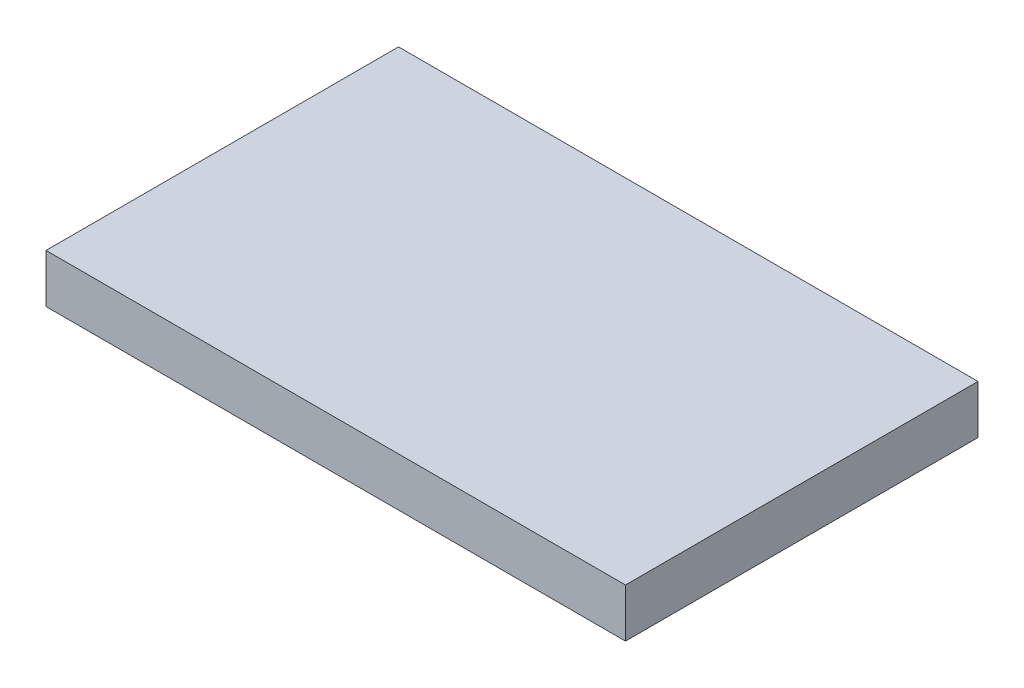
ISO-10303-21;
HEADER;
FILE_DESCRIPTION(('STEP AP214'),'2;1');
FILE_NAME('part.step','',(''),(''),'','','');
FILE_SCHEMA(('AUTOMOTIVE_DESIGN { 1 0 10303 214 1 1 1 1 }'));
ENDSEC;
DATA;
#1=APPLICATION_CONTEXT('core data for automotive mechanical design processes');
#2=APPLICATION_PROTOCOL_DEFINITION('international standard','automotive_design',2000,#1);
#3=PRODUCT_CONTEXT('',#1,'mechanical');
#4=PRODUCT('Part','Part','',(#3));
#5=PRODUCT_RELATED_PRODUCT_CATEGORY('part','',(#4));
#6=PRODUCT_DEFINITION_FORMATION('','',#4);
#7=PRODUCT_DEFINITION_CONTEXT('part definition',#1,'design');
#8=PRODUCT_DEFINITION('design','',#6,#7);
#9=PRODUCT_DEFINITION_SHAPE('','',#8);
#10=(LENGTH_UNIT() NAMED_UNIT(*) SI_UNIT(.MILLI.,.METRE.));
#11=(NAMED_UNIT(*) PLANE_ANGLE_UNIT() SI_UNIT($,.RADIAN.));
#12=(NAMED_UNIT(*) SI_UNIT($,.STERADIAN.) SOLID_ANGLE_UNIT());
#13=UNCERTAINTY_MEASURE_WITH_UNIT(LENGTH_MEASURE(1.E-05),#10,'distance_accuracy_value','');
#14=(GEOMETRIC_REPRESENTATION_CONTEXT(3) GLOBAL_UNCERTAINTY_ASSIGNED_CONTEXT((#13)) GLOBAL_UNIT_ASSIGNED_CONTEXT((#10,
#11,#12)) REPRESENTATION_CONTEXT('',''));
#15=CARTESIAN_POINT('',(0.,0.,0.));
#16=DIRECTION('',(0.,0.,1.));
#17=DIRECTION('',(1.,0.,0.));
#18=AXIS2_PLACEMENT_3D('',#15,#16,#17);
#19=CARTESIAN_POINT('',(124.620801033592,12.,-51.3989018087855));
#20=DIRECTION('',(0.,0.,1.));
#21=DIRECTION('',(1.,0.,0.));
#22=AXIS2_PLACEMENT_3D('',#19,#20,#21);
#23=PLANE('',#22);
#24=DIRECTION('',(-1.,0.,0.));
#25=VECTOR('',#24,1.);
#26=CARTESIAN_POINT('',(124.620801033592,0.,-51.3989018087855));
#27=LINE('',#26,#25);
#28=CARTESIAN_POINT('',(124.620801033592,0.,-51.3989018087855));
#29=VERTEX_POINT('',#28);
#30=CARTESIAN_POINT('',(-18.3791989664082,0.,-51.3989018087855));
#31=VERTEX_POINT('',#30);
#32=EDGE_CURVE('E95',#29,#31,#27,.T.);
#33=ORIENTED_EDGE('',*,*,#32,.T.);
#34=DIRECTION('',(0.,-1.,0.));
#35=VECTOR('',#34,1.);
#36=CARTESIAN_POINT('',(-18.3791989664082,12.,-51.3989018087855));
#37=LINE('',#36,#35);
#38=CARTESIAN_POINT('',(-18.3791989664082,12.,-51.3989018087855));
#39=VERTEX_POINT('',#38);
#40=EDGE_CURVE('E11',#39,#31,#37,.T.);
#41=ORIENTED_EDGE('',*,*,#40,.F.);
#42=DIRECTION('',(-1.,0.,0.));
#43=VECTOR('',#42,1.);
#44=CARTESIAN_POINT('',(124.620801033592,12.,-51.3989018087855));
#45=LINE('',#44,#43);
#46=CARTESIAN_POINT('',(124.620801033592,12.,-51.3989018087855));
#47=VERTEX_POINT('',#46);
#48=EDGE_CURVE('E83',#47,#39,#45,.T.);
#49=ORIENTED_EDGE('',*,*,#48,.F.);
#50=DIRECTION('',(0.,-1.,0.));
#51=VECTOR('',#50,1.);
#52=CARTESIAN_POINT('',(124.620801033592,12.,-51.3989018087855));
#53=LINE('',#52,#51);
#54=EDGE_CURVE('E91',#47,#29,#53,.T.);
#55=ORIENTED_EDGE('',*,*,#54,.T.);
#56=EDGE_LOOP('',(#33,#41,#49,#55));
#57=FACE_BOUND('',#56,.T.);
#58=ADVANCED_FACE('F32',(#57),#23,.F.);
#59=CARTESIAN_POINT('',(-18.3791989664082,12.,-51.3989018087855));
#60=DIRECTION('',(1.,0.,0.));
#61=DIRECTION('',(0.,0.,-1.));
#62=AXIS2_PLACEMENT_3D('',#59,#60,#61);
#63=PLANE('',#62);
#64=DIRECTION('',(0.,0.,1.));
#65=VECTOR('',#64,1.);
#66=CARTESIAN_POINT('',(-18.3791989664082,0.,-51.3989018087855));
#67=LINE('',#66,#65);
#68=CARTESIAN_POINT('',(-18.3791989664082,0.,35.6010981912145));
#69=VERTEX_POINT('',#68);
#70=EDGE_CURVE('E87',#31,#69,#67,.T.);
#71=ORIENTED_EDGE('',*,*,#70,.T.);
#72=DIRECTION('',(0.,-1.,0.));
#73=VECTOR('',#72,1.);
#74=CARTESIAN_POINT('',(-18.3791989664082,12.,35.6010981912145));
#75=LINE('',#74,#73);
#76=CARTESIAN_POINT('',(-18.3791989664082,12.,35.6010981912145));
#77=VERTEX_POINT('',#76);
#78=EDGE_CURVE('E40',#77,#69,#75,.T.);
#79=ORIENTED_EDGE('',*,*,#78,.F.);
#80=DIRECTION('',(0.,0.,1.));
#81=VECTOR('',#80,1.);
#82=CARTESIAN_POINT('',(-18.3791989664082,12.,-51.3989018087855));
#83=LINE('',#82,#81);
#84=EDGE_CURVE('E78',#39,#77,#83,.T.);
#85=ORIENTED_EDGE('',*,*,#84,.F.);
#86=ORIENTED_EDGE('',*,*,#40,.T.);
#87=EDGE_LOOP('',(#71,#79,#85,#86));
#88=FACE_BOUND('',#87,.T.);
#89=ADVANCED_FACE('F86',(#88),#63,.F.);
#90=CARTESIAN_POINT('',(-18.3791989664082,12.,35.6010981912145));
#91=DIRECTION('',(0.,0.,-1.));
#92=DIRECTION('',(-1.,0.,0.));
#93=AXIS2_PLACEMENT_3D('',#90,#91,#92);
#94=PLANE('',#93);
#95=DIRECTION('',(1.,0.,0.));
#96=VECTOR('',#95,1.);
#97=CARTESIAN_POINT('',(-18.3791989664082,0.,35.6010981912145));
#98=LINE('',#97,#96);
#99=CARTESIAN_POINT('',(124.620801033592,0.,35.6010981912145));
#100=VERTEX_POINT('',#99);
#101=EDGE_CURVE('E65',#69,#100,#98,.T.);
#102=ORIENTED_EDGE('',*,*,#101,.T.);
#103=DIRECTION('',(0.,-1.,0.));
#104=VECTOR('',#103,1.);
#105=CARTESIAN_POINT('',(124.620801033592,12.,35.6010981912145));
#106=LINE('',#105,#104);
#107=CARTESIAN_POINT('',(124.620801033592,12.,35.6010981912145));
#108=VERTEX_POINT('',#107);
#109=EDGE_CURVE('E88',#108,#100,#106,.T.);
#110=ORIENTED_EDGE('',*,*,#109,.F.);
#111=DIRECTION('',(1.,0.,0.));
#112=VECTOR('',#111,1.);
#113=CARTESIAN_POINT('',(-18.3791989664082,12.,35.6010981912145));
#114=LINE('',#113,#112);
#115=EDGE_CURVE('E81',#77,#108,#114,.T.);
#116=ORIENTED_EDGE('',*,*,#115,.F.);
#117=ORIENTED_EDGE('',*,*,#78,.T.);
#118=EDGE_LOOP('',(#102,#110,#116,#117));
#119=FACE_BOUND('',#118,.T.);
#120=ADVANCED_FACE('F89',(#119),#94,.F.);
#121=CARTESIAN_POINT('',(124.620801033592,12.,35.6010981912145));
#122=DIRECTION('',(-1.,0.,0.));
#123=DIRECTION('',(0.,0.,1.));
#124=AXIS2_PLACEMENT_3D('',#121,#122,#123);
#125=PLANE('',#124);
#126=DIRECTION('',(0.,0.,-1.));
#127=VECTOR('',#126,1.);
#128=CARTESIAN_POINT('',(124.620801033592,0.,35.6010981912145));
#129=LINE('',#128,#127);
#130=EDGE_CURVE('E71',#100,#29,#129,.T.);
#131=ORIENTED_EDGE('',*,*,#130,.T.);
#132=ORIENTED_EDGE('',*,*,#54,.F.);
#133=DIRECTION('',(0.,0.,-1.));
#134=VECTOR('',#133,1.);
#135=CARTESIAN_POINT('',(124.620801033592,12.,35.6010981912145));
#136=LINE('',#135,#134);
#137=EDGE_CURVE('E48',#108,#47,#136,.T.);
#138=ORIENTED_EDGE('',*,*,#137,.F.);
#139=ORIENTED_EDGE('',*,*,#109,.T.);
#140=EDGE_LOOP('',(#131,#132,#138,#139));
#141=FACE_BOUND('',#140,.T.);
#142=ADVANCED_FACE('F102',(#141),#125,.F.);
#143=CARTESIAN_POINT('',(0.,12.,0.));
#144=DIRECTION('',(0.,1.,0.));
#145=DIRECTION('',(0.,0.,1.));
#146=AXIS2_PLACEMENT_3D('',#143,#144,#145);
#147=PLANE('',#146);
#148=ORIENTED_EDGE('',*,*,#48,.T.);
#149=ORIENTED_EDGE('',*,*,#84,.T.);
#150=ORIENTED_EDGE('',*,*,#115,.T.);
#151=ORIENTED_EDGE('',*,*,#137,.T.);
#152=EDGE_LOOP('',(#148,#149,#150,#151));
#153=FACE_BOUND('',#152,.T.);
#154=ADVANCED_FACE('F79',(#153),#147,.T.);
#155=CARTESIAN_POINT('',(0.,0.,0.));
#156=DIRECTION('',(0.,1.,0.));
#157=DIRECTION('',(0.,0.,1.));
#158=AXIS2_PLACEMENT_3D('',#155,#156,#157);
#159=PLANE('',#158);
#160=ORIENTED_EDGE('',*,*,#32,.F.);
#161=ORIENTED_EDGE('',*,*,#130,.F.);
#162=ORIENTED_EDGE('',*,*,#101,.F.);
#163=ORIENTED_EDGE('',*,*,#70,.F.);
#164=EDGE_LOOP('',(#160,#161,#162,#163));
#165=FACE_BOUND('',#164,.T.);
#166=ADVANCED_FACE('F105',(#165),#159,.F.);
#167=CLOSED_SHELL('',(#58,#89,#120,#142,#154,#166));
#168=MANIFOLD_SOLID_BREP('B2',#167);
#169=ADVANCED_BREP_SHAPE_REPRESENTATION('',(#18,#168),#14);
#170=SHAPE_DEFINITION_REPRESENTATION(#9,#169);
ENDSEC;
END-ISO-10303-21;
